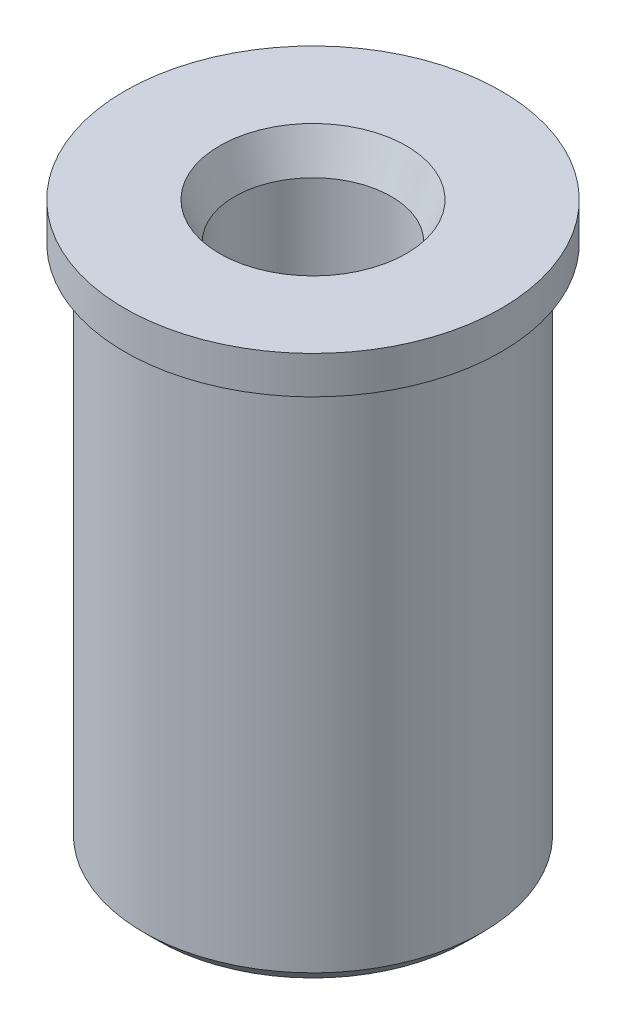
ISO-10303-21;
HEADER;
FILE_DESCRIPTION(('STEP AP214'),'2;1');
FILE_NAME('part.step','',(''),(''),'','','');
FILE_SCHEMA(('AUTOMOTIVE_DESIGN { 1 0 10303 214 1 1 1 1 }'));
ENDSEC;
DATA;
#1=APPLICATION_CONTEXT('core data for automotive mechanical design processes');
#2=APPLICATION_PROTOCOL_DEFINITION('international standard','automotive_design',2000,#1);
#3=PRODUCT_CONTEXT('',#1,'mechanical');
#4=PRODUCT('Part','Part','',(#3));
#5=PRODUCT_RELATED_PRODUCT_CATEGORY('part','',(#4));
#6=PRODUCT_DEFINITION_FORMATION('','',#4);
#7=PRODUCT_DEFINITION_CONTEXT('part definition',#1,'design');
#8=PRODUCT_DEFINITION('design','',#6,#7);
#9=PRODUCT_DEFINITION_SHAPE('','',#8);
#10=(LENGTH_UNIT() NAMED_UNIT(*) SI_UNIT(.MILLI.,.METRE.));
#11=(NAMED_UNIT(*) PLANE_ANGLE_UNIT() SI_UNIT($,.RADIAN.));
#12=(NAMED_UNIT(*) SI_UNIT($,.STERADIAN.) SOLID_ANGLE_UNIT());
#13=UNCERTAINTY_MEASURE_WITH_UNIT(LENGTH_MEASURE(1.E-05),#10,'distance_accuracy_value','');
#14=(GEOMETRIC_REPRESENTATION_CONTEXT(3) GLOBAL_UNCERTAINTY_ASSIGNED_CONTEXT((#13)) GLOBAL_UNIT_ASSIGNED_CONTEXT((#10,
#11,#12)) REPRESENTATION_CONTEXT('',''));
#15=CARTESIAN_POINT('',(0.,0.,0.));
#16=DIRECTION('',(0.,0.,1.));
#17=DIRECTION('',(1.,0.,0.));
#18=AXIS2_PLACEMENT_3D('',#15,#16,#17);
#19=CARTESIAN_POINT('',(0.,6.35000000000002,0.));
#20=DIRECTION('',(0.,1.,0.));
#21=DIRECTION('',(-1.,0.,0.));
#22=AXIS2_PLACEMENT_3D('',#19,#20,#21);
#23=PLANE('',#22);
#24=CARTESIAN_POINT('',(0.,6.35000000000002,0.));
#25=DIRECTION('',(0.,1.,0.));
#26=DIRECTION('',(0.,0.,1.));
#27=AXIS2_PLACEMENT_3D('',#24,#25,#26);
#28=CIRCLE('',#27,1.5748);
#29=CARTESIAN_POINT('',(0.,6.35000000000002,1.5748));
#30=VERTEX_POINT('',#29);
#31=EDGE_CURVE('E46',#30,#30,#28,.T.);
#32=ORIENTED_EDGE('',*,*,#31,.F.);
#33=EDGE_LOOP('',(#32));
#34=FACE_BOUND('',#33,.T.);
#35=CARTESIAN_POINT('',(0.,6.35000000000003,0.));
#36=DIRECTION('',(0.,-1.,0.));
#37=DIRECTION('',(1.,0.,0.));
#38=AXIS2_PLACEMENT_3D('',#35,#36,#37);
#39=CIRCLE('',#38,3.175);
#40=CARTESIAN_POINT('',(3.17500000000003,6.35000000000004,0.));
#41=VERTEX_POINT('',#40);
#42=EDGE_CURVE('E10',#41,#41,#39,.T.);
#43=ORIENTED_EDGE('',*,*,#42,.F.);
#44=EDGE_LOOP('',(#43));
#45=FACE_BOUND('',#44,.T.);
#46=ADVANCED_FACE('F24',(#34,#45),#23,.T.);
#47=CARTESIAN_POINT('',(0.,0.,0.));
#48=DIRECTION('',(0.,-1.,0.));
#49=DIRECTION('',(1.,0.,0.));
#50=AXIS2_PLACEMENT_3D('',#47,#48,#49);
#51=CYLINDRICAL_SURFACE('',#50,3.175);
#52=ORIENTED_EDGE('',*,*,#42,.T.);
#53=EDGE_LOOP('',(#52));
#54=FACE_BOUND('',#53,.T.);
#55=CARTESIAN_POINT('',(0.,5.71500000000006,0.));
#56=DIRECTION('',(0.,-1.,0.));
#57=DIRECTION('',(1.,0.,0.));
#58=AXIS2_PLACEMENT_3D('',#55,#56,#57);
#59=CIRCLE('',#58,3.175);
#60=CARTESIAN_POINT('',(3.17500000000004,5.71500000000007,0.));
#61=VERTEX_POINT('',#60);
#62=EDGE_CURVE('E30',#61,#61,#59,.T.);
#63=ORIENTED_EDGE('',*,*,#62,.F.);
#64=EDGE_LOOP('',(#63));
#65=FACE_BOUND('',#64,.T.);
#66=ADVANCED_FACE('F82',(#54,#65),#51,.T.);
#67=CARTESIAN_POINT('',(0.,5.71500000000006,0.));
#68=DIRECTION('',(0.,1.,0.));
#69=DIRECTION('',(-1.,0.,0.));
#70=AXIS2_PLACEMENT_3D('',#67,#68,#69);
#71=PLANE('',#70);
#72=CARTESIAN_POINT('',(0.,5.71500000000006,0.));
#73=DIRECTION('',(0.,-1.,0.));
#74=DIRECTION('',(1.,0.,0.));
#75=AXIS2_PLACEMENT_3D('',#72,#73,#74);
#76=CIRCLE('',#75,2.85750000000003);
#77=CARTESIAN_POINT('',(2.85750000000006,5.71500000000007,0.));
#78=VERTEX_POINT('',#77);
#79=EDGE_CURVE('E34',#78,#78,#76,.T.);
#80=ORIENTED_EDGE('',*,*,#79,.F.);
#81=EDGE_LOOP('',(#80));
#82=FACE_BOUND('',#81,.T.);
#83=ORIENTED_EDGE('',*,*,#62,.T.);
#84=EDGE_LOOP('',(#83));
#85=FACE_BOUND('',#84,.T.);
#86=ADVANCED_FACE('F88',(#82,#85),#71,.F.);
#87=CARTESIAN_POINT('',(0.,0.,0.));
#88=DIRECTION('',(0.,-1.,0.));
#89=DIRECTION('',(1.,0.,0.));
#90=AXIS2_PLACEMENT_3D('',#87,#88,#89);
#91=CYLINDRICAL_SURFACE('',#90,2.85750000000005);
#92=CARTESIAN_POINT('',(0.,-2.92099999999996,0.));
#93=DIRECTION('',(0.,-1.,0.));
#94=DIRECTION('',(1.,0.,0.));
#95=AXIS2_PLACEMENT_3D('',#92,#93,#94);
#96=CIRCLE('',#95,2.85750000000007);
#97=CARTESIAN_POINT('',(2.85750000000014,-2.92099999999995,0.));
#98=VERTEX_POINT('',#97);
#99=EDGE_CURVE('E38',#98,#98,#96,.T.);
#100=ORIENTED_EDGE('',*,*,#99,.F.);
#101=EDGE_LOOP('',(#100));
#102=FACE_BOUND('',#101,.T.);
#103=ORIENTED_EDGE('',*,*,#79,.T.);
#104=EDGE_LOOP('',(#103));
#105=FACE_BOUND('',#104,.T.);
#106=ADVANCED_FACE('F92',(#102,#105),#91,.T.);
#107=CARTESIAN_POINT('',(0.,-2.92099999999996,0.));
#108=DIRECTION('',(0.,1.,0.));
#109=DIRECTION('',(-1.,0.,0.));
#110=AXIS2_PLACEMENT_3D('',#107,#108,#109);
#111=CONICAL_SURFACE('',#110,2.85750000000007,0.785398163397389);
#112=CARTESIAN_POINT('',(0.,-3.17499999999997,0.));
#113=DIRECTION('',(0.,-1.,0.));
#114=DIRECTION('',(1.,0.,0.));
#115=AXIS2_PLACEMENT_3D('',#112,#113,#114);
#116=CIRCLE('',#115,2.6035000000001);
#117=CARTESIAN_POINT('',(2.60350000000016,-3.17499999999996,0.));
#118=VERTEX_POINT('',#117);
#119=EDGE_CURVE('E43',#118,#118,#116,.T.);
#120=ORIENTED_EDGE('',*,*,#119,.F.);
#121=EDGE_LOOP('',(#120));
#122=FACE_BOUND('',#121,.T.);
#123=ORIENTED_EDGE('',*,*,#99,.T.);
#124=EDGE_LOOP('',(#123));
#125=FACE_BOUND('',#124,.T.);
#126=ADVANCED_FACE('F99',(#122,#125),#111,.T.);
#127=CARTESIAN_POINT('',(0.,-3.17499999999997,0.));
#128=DIRECTION('',(0.,1.,0.));
#129=DIRECTION('',(-1.,0.,0.));
#130=AXIS2_PLACEMENT_3D('',#127,#128,#129);
#131=PLANE('',#130);
#132=CARTESIAN_POINT('',(0.,-3.17499999999999,0.));
#133=DIRECTION('',(0.,1.,0.));
#134=DIRECTION('',(0.,0.,1.));
#135=AXIS2_PLACEMENT_3D('',#132,#133,#134);
#136=CIRCLE('',#135,1.5748);
#137=CARTESIAN_POINT('',(0.,-3.17499999999999,1.5748));
#138=VERTEX_POINT('',#137);
#139=EDGE_CURVE('E55',#138,#138,#136,.T.);
#140=ORIENTED_EDGE('',*,*,#139,.T.);
#141=EDGE_LOOP('',(#140));
#142=FACE_BOUND('',#141,.T.);
#143=ORIENTED_EDGE('',*,*,#119,.T.);
#144=EDGE_LOOP('',(#143));
#145=FACE_BOUND('',#144,.T.);
#146=ADVANCED_FACE('F59',(#142,#145),#131,.F.);
#147=CARTESIAN_POINT('',(0.,6.35000000000002,0.));
#148=DIRECTION('',(0.,1.,0.));
#149=DIRECTION('',(0.,0.,1.));
#150=AXIS2_PLACEMENT_3D('',#147,#148,#149);
#151=CONICAL_SURFACE('',#150,1.5748,0.392699081698721);
#152=CARTESIAN_POINT('',(0.,5.73678975515725,0.));
#153=DIRECTION('',(0.,1.,0.));
#154=DIRECTION('',(0.,0.,1.));
#155=AXIS2_PLACEMENT_3D('',#152,#153,#154);
#156=CIRCLE('',#155,1.3208);
#157=CARTESIAN_POINT('',(0.,5.73678975515725,1.3208));
#158=VERTEX_POINT('',#157);
#159=EDGE_CURVE('E49',#158,#158,#156,.T.);
#160=ORIENTED_EDGE('',*,*,#159,.F.);
#161=EDGE_LOOP('',(#160));
#162=FACE_BOUND('',#161,.T.);
#163=ORIENTED_EDGE('',*,*,#31,.T.);
#164=EDGE_LOOP('',(#163));
#165=FACE_BOUND('',#164,.T.);
#166=ADVANCED_FACE('F71',(#162,#165),#151,.F.);
#167=CARTESIAN_POINT('',(0.,6.35000000000002,0.));
#168=DIRECTION('',(0.,1.,0.));
#169=DIRECTION('',(0.,0.,1.));
#170=AXIS2_PLACEMENT_3D('',#167,#168,#169);
#171=CYLINDRICAL_SURFACE('',#170,1.3208);
#172=CARTESIAN_POINT('',(0.,-2.56178975515722,0.));
#173=DIRECTION('',(0.,1.,0.));
#174=DIRECTION('',(0.,0.,1.));
#175=AXIS2_PLACEMENT_3D('',#172,#173,#174);
#176=CIRCLE('',#175,1.3208);
#177=CARTESIAN_POINT('',(0.,-2.56178975515722,1.3208));
#178=VERTEX_POINT('',#177);
#179=EDGE_CURVE('E52',#178,#178,#176,.T.);
#180=ORIENTED_EDGE('',*,*,#179,.F.);
#181=EDGE_LOOP('',(#180));
#182=FACE_BOUND('',#181,.T.);
#183=ORIENTED_EDGE('',*,*,#159,.T.);
#184=EDGE_LOOP('',(#183));
#185=FACE_BOUND('',#184,.T.);
#186=ADVANCED_FACE('F65',(#182,#185),#171,.F.);
#187=CARTESIAN_POINT('',(0.,-2.56178975515722,0.));
#188=DIRECTION('',(0.,-1.,0.));
#189=DIRECTION('',(0.,0.,-1.));
#190=AXIS2_PLACEMENT_3D('',#187,#188,#189);
#191=CONICAL_SURFACE('',#190,1.3208,0.392699081698725);
#192=ORIENTED_EDGE('',*,*,#139,.F.);
#193=EDGE_LOOP('',(#192));
#194=FACE_BOUND('',#193,.T.);
#195=ORIENTED_EDGE('',*,*,#179,.T.);
#196=EDGE_LOOP('',(#195));
#197=FACE_BOUND('',#196,.T.);
#198=ADVANCED_FACE('F62',(#194,#197),#191,.F.);
#199=CLOSED_SHELL('',(#46,#66,#86,#106,#126,#146,#166,#186,#198));
#200=MANIFOLD_SOLID_BREP('B2',#199);
#201=ADVANCED_BREP_SHAPE_REPRESENTATION('',(#18,#200),#14);
#202=SHAPE_DEFINITION_REPRESENTATION(#9,#201);
ENDSEC;
END-ISO-10303-21;
